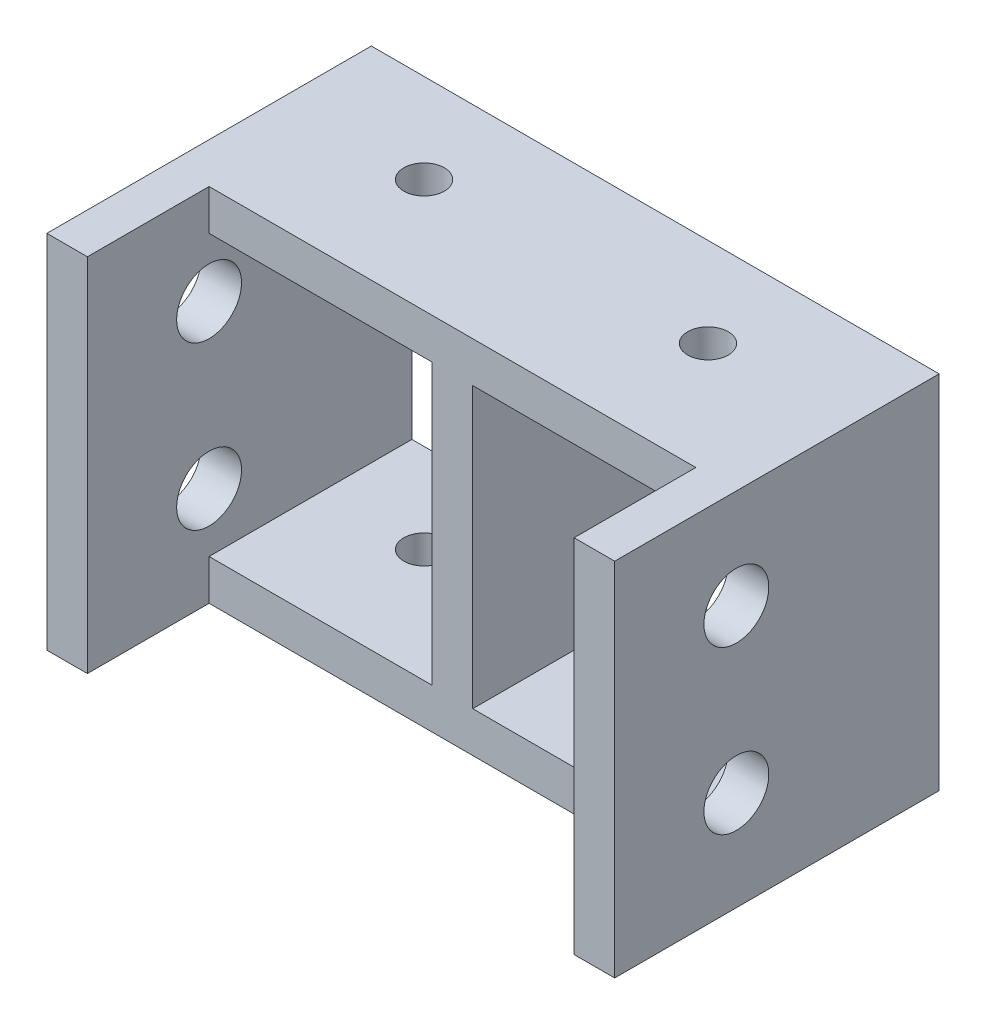
ISO-10303-21;
HEADER;
FILE_DESCRIPTION(('STEP AP214'),'2;1');
FILE_NAME('part.step','',(''),(''),'','','');
FILE_SCHEMA(('AUTOMOTIVE_DESIGN { 1 0 10303 214 1 1 1 1 }'));
ENDSEC;
DATA;
#1=APPLICATION_CONTEXT('core data for automotive mechanical design processes');
#2=APPLICATION_PROTOCOL_DEFINITION('international standard','automotive_design',2000,#1);
#3=PRODUCT_CONTEXT('',#1,'mechanical');
#4=PRODUCT('Part','Part','',(#3));
#5=PRODUCT_RELATED_PRODUCT_CATEGORY('part','',(#4));
#6=PRODUCT_DEFINITION_FORMATION('','',#4);
#7=PRODUCT_DEFINITION_CONTEXT('part definition',#1,'design');
#8=PRODUCT_DEFINITION('design','',#6,#7);
#9=PRODUCT_DEFINITION_SHAPE('','',#8);
#10=(LENGTH_UNIT() NAMED_UNIT(*) SI_UNIT(.MILLI.,.METRE.));
#11=(NAMED_UNIT(*) PLANE_ANGLE_UNIT() SI_UNIT($,.RADIAN.));
#12=(NAMED_UNIT(*) SI_UNIT($,.STERADIAN.) SOLID_ANGLE_UNIT());
#13=UNCERTAINTY_MEASURE_WITH_UNIT(LENGTH_MEASURE(1.E-05),#10,'distance_accuracy_value','');
#14=(GEOMETRIC_REPRESENTATION_CONTEXT(3) GLOBAL_UNCERTAINTY_ASSIGNED_CONTEXT((#13)) GLOBAL_UNIT_ASSIGNED_CONTEXT((#10,
#11,#12)) REPRESENTATION_CONTEXT('',''));
#15=CARTESIAN_POINT('',(0.,0.,0.));
#16=DIRECTION('',(0.,0.,1.));
#17=DIRECTION('',(1.,0.,0.));
#18=AXIS2_PLACEMENT_3D('',#15,#16,#17);
#19=CARTESIAN_POINT('',(0.,0.,50.));
#20=DIRECTION('',(0.,0.,1.));
#21=DIRECTION('',(1.,0.,0.));
#22=AXIS2_PLACEMENT_3D('',#19,#20,#21);
#23=PLANE('',#22);
#24=DIRECTION('',(1.,0.,0.));
#25=VECTOR('',#24,1.);
#26=CARTESIAN_POINT('',(-70.,-44.980959066833,50.));
#27=LINE('',#26,#25);
#28=CARTESIAN_POINT('',(-60.,-44.980959066833,50.));
#29=VERTEX_POINT('',#28);
#30=CARTESIAN_POINT('',(60.,-44.980959066833,50.));
#31=VERTEX_POINT('',#30);
#32=EDGE_CURVE('E50',#29,#31,#27,.T.);
#33=ORIENTED_EDGE('',*,*,#32,.T.);
#34=DIRECTION('',(0.,-1.,0.));
#35=VECTOR('',#34,1.);
#36=CARTESIAN_POINT('',(60.,44.019040933167,50.));
#37=LINE('',#36,#35);
#38=CARTESIAN_POINT('',(60.,-34.980959066833,50.));
#39=VERTEX_POINT('',#38);
#40=EDGE_CURVE('E181',#39,#31,#37,.T.);
#41=ORIENTED_EDGE('',*,*,#40,.F.);
#42=DIRECTION('',(1.,0.,0.));
#43=VECTOR('',#42,1.);
#44=CARTESIAN_POINT('',(5.,-34.980959066833,50.));
#45=LINE('',#44,#43);
#46=CARTESIAN_POINT('',(5.,-34.980959066833,50.));
#47=VERTEX_POINT('',#46);
#48=EDGE_CURVE('E237',#47,#39,#45,.T.);
#49=ORIENTED_EDGE('',*,*,#48,.F.);
#50=DIRECTION('',(0.,-1.,0.));
#51=VECTOR('',#50,1.);
#52=CARTESIAN_POINT('',(5.,34.019040933167,50.));
#53=LINE('',#52,#51);
#54=CARTESIAN_POINT('',(5.,34.019040933167,50.));
#55=VERTEX_POINT('',#54);
#56=EDGE_CURVE('E244',#55,#47,#53,.T.);
#57=ORIENTED_EDGE('',*,*,#56,.F.);
#58=DIRECTION('',(-1.,0.,0.));
#59=VECTOR('',#58,1.);
#60=CARTESIAN_POINT('',(5.,34.019040933167,50.));
#61=LINE('',#60,#59);
#62=CARTESIAN_POINT('',(60.,34.019040933167,50.));
#63=VERTEX_POINT('',#62);
#64=EDGE_CURVE('E240',#63,#55,#61,.T.);
#65=ORIENTED_EDGE('',*,*,#64,.F.);
#66=CARTESIAN_POINT('',(60.,44.019040933167,50.));
#67=VERTEX_POINT('',#66);
#68=EDGE_CURVE('E57',#67,#63,#37,.T.);
#69=ORIENTED_EDGE('',*,*,#68,.F.);
#70=DIRECTION('',(-1.,0.,0.));
#71=VECTOR('',#70,1.);
#72=CARTESIAN_POINT('',(-70.,44.019040933167,50.));
#73=LINE('',#72,#71);
#74=CARTESIAN_POINT('',(-60.,44.019040933167,50.));
#75=VERTEX_POINT('',#74);
#76=EDGE_CURVE('E298',#67,#75,#73,.T.);
#77=ORIENTED_EDGE('',*,*,#76,.T.);
#78=DIRECTION('',(0.,-1.,0.));
#79=VECTOR('',#78,1.);
#80=CARTESIAN_POINT('',(-60.,44.019040933167,50.));
#81=LINE('',#80,#79);
#82=CARTESIAN_POINT('',(-60.,34.019040933167,50.));
#83=VERTEX_POINT('',#82);
#84=EDGE_CURVE('E190',#75,#83,#81,.T.);
#85=ORIENTED_EDGE('',*,*,#84,.T.);
#86=DIRECTION('',(-1.,0.,0.));
#87=VECTOR('',#86,1.);
#88=CARTESIAN_POINT('',(-60.,34.019040933167,50.));
#89=LINE('',#88,#87);
#90=CARTESIAN_POINT('',(-5.,34.019040933167,50.));
#91=VERTEX_POINT('',#90);
#92=EDGE_CURVE('E273',#91,#83,#89,.T.);
#93=ORIENTED_EDGE('',*,*,#92,.F.);
#94=DIRECTION('',(0.,1.,0.));
#95=VECTOR('',#94,1.);
#96=CARTESIAN_POINT('',(-5.,34.019040933167,50.));
#97=LINE('',#96,#95);
#98=CARTESIAN_POINT('',(-5.,-34.980959066833,50.));
#99=VERTEX_POINT('',#98);
#100=EDGE_CURVE('E269',#99,#91,#97,.T.);
#101=ORIENTED_EDGE('',*,*,#100,.F.);
#102=DIRECTION('',(1.,0.,0.));
#103=VECTOR('',#102,1.);
#104=CARTESIAN_POINT('',(-60.,-34.980959066833,50.));
#105=LINE('',#104,#103);
#106=CARTESIAN_POINT('',(-60.,-34.980959066833,50.));
#107=VERTEX_POINT('',#106);
#108=EDGE_CURVE('E267',#107,#99,#105,.T.);
#109=ORIENTED_EDGE('',*,*,#108,.F.);
#110=EDGE_CURVE('E183',#107,#29,#81,.T.);
#111=ORIENTED_EDGE('',*,*,#110,.T.);
#112=EDGE_LOOP('',(#33,#41,#49,#57,#65,#69,#77,#85,#93,#101,#109,#111));
#113=FACE_BOUND('',#112,.T.);
#114=ADVANCED_FACE('F35',(#113),#23,.T.);
#115=CARTESIAN_POINT('',(0.,0.,0.));
#116=DIRECTION('',(0.,0.,1.));
#117=DIRECTION('',(1.,0.,0.));
#118=AXIS2_PLACEMENT_3D('',#115,#116,#117);
#119=PLANE('',#118);
#120=DIRECTION('',(0.,-1.,0.));
#121=VECTOR('',#120,1.);
#122=CARTESIAN_POINT('',(-60.,34.019040933167,0.));
#123=LINE('',#122,#121);
#124=CARTESIAN_POINT('',(-60.,34.019040933167,0.));
#125=VERTEX_POINT('',#124);
#126=CARTESIAN_POINT('',(-60.,-34.980959066833,0.));
#127=VERTEX_POINT('',#126);
#128=EDGE_CURVE('E266',#125,#127,#123,.T.);
#129=ORIENTED_EDGE('',*,*,#128,.T.);
#130=DIRECTION('',(1.,0.,0.));
#131=VECTOR('',#130,1.);
#132=CARTESIAN_POINT('',(-60.,-34.980959066833,0.));
#133=LINE('',#132,#131);
#134=CARTESIAN_POINT('',(-5.,-34.980959066833,0.));
#135=VERTEX_POINT('',#134);
#136=EDGE_CURVE('E279',#127,#135,#133,.T.);
#137=ORIENTED_EDGE('',*,*,#136,.T.);
#138=DIRECTION('',(0.,1.,0.));
#139=VECTOR('',#138,1.);
#140=CARTESIAN_POINT('',(-5.,34.019040933167,0.));
#141=LINE('',#140,#139);
#142=CARTESIAN_POINT('',(-5.,34.019040933167,0.));
#143=VERTEX_POINT('',#142);
#144=EDGE_CURVE('E282',#135,#143,#141,.T.);
#145=ORIENTED_EDGE('',*,*,#144,.T.);
#146=DIRECTION('',(-1.,0.,0.));
#147=VECTOR('',#146,1.);
#148=CARTESIAN_POINT('',(-60.,34.019040933167,0.));
#149=LINE('',#148,#147);
#150=EDGE_CURVE('E270',#143,#125,#149,.T.);
#151=ORIENTED_EDGE('',*,*,#150,.T.);
#152=EDGE_LOOP('',(#129,#137,#145,#151));
#153=FACE_BOUND('',#152,.T.);
#154=DIRECTION('',(0.,-1.,0.));
#155=VECTOR('',#154,1.);
#156=CARTESIAN_POINT('',(-70.,44.019040933167,0.));
#157=LINE('',#156,#155);
#158=CARTESIAN_POINT('',(-70.,44.019040933167,0.));
#159=VERTEX_POINT('',#158);
#160=CARTESIAN_POINT('',(-70.,-44.980959066833,0.));
#161=VERTEX_POINT('',#160);
#162=EDGE_CURVE('E296',#159,#161,#157,.T.);
#163=ORIENTED_EDGE('',*,*,#162,.F.);
#164=DIRECTION('',(-1.,0.,0.));
#165=VECTOR('',#164,1.);
#166=CARTESIAN_POINT('',(-70.,44.019040933167,0.));
#167=LINE('',#166,#165);
#168=CARTESIAN_POINT('',(70.,44.019040933167,0.));
#169=VERTEX_POINT('',#168);
#170=EDGE_CURVE('E299',#169,#159,#167,.T.);
#171=ORIENTED_EDGE('',*,*,#170,.F.);
#172=DIRECTION('',(0.,1.,0.));
#173=VECTOR('',#172,1.);
#174=CARTESIAN_POINT('',(70.,44.019040933167,0.));
#175=LINE('',#174,#173);
#176=CARTESIAN_POINT('',(70.,-44.980959066833,0.));
#177=VERTEX_POINT('',#176);
#178=EDGE_CURVE('E156',#177,#169,#175,.T.);
#179=ORIENTED_EDGE('',*,*,#178,.F.);
#180=DIRECTION('',(1.,0.,0.));
#181=VECTOR('',#180,1.);
#182=CARTESIAN_POINT('',(-70.,-44.980959066833,0.));
#183=LINE('',#182,#181);
#184=EDGE_CURVE('E303',#161,#177,#183,.T.);
#185=ORIENTED_EDGE('',*,*,#184,.F.);
#186=EDGE_LOOP('',(#163,#171,#179,#185));
#187=FACE_BOUND('',#186,.T.);
#188=DIRECTION('',(1.,0.,0.));
#189=VECTOR('',#188,1.);
#190=CARTESIAN_POINT('',(5.,-34.980959066833,0.));
#191=LINE('',#190,#189);
#192=CARTESIAN_POINT('',(5.,-34.980959066833,0.));
#193=VERTEX_POINT('',#192);
#194=CARTESIAN_POINT('',(60.,-34.980959066833,0.));
#195=VERTEX_POINT('',#194);
#196=EDGE_CURVE('E236',#193,#195,#191,.T.);
#197=ORIENTED_EDGE('',*,*,#196,.T.);
#198=DIRECTION('',(0.,1.,0.));
#199=VECTOR('',#198,1.);
#200=CARTESIAN_POINT('',(60.,34.019040933167,0.));
#201=LINE('',#200,#199);
#202=CARTESIAN_POINT('',(60.,34.019040933167,0.));
#203=VERTEX_POINT('',#202);
#204=EDGE_CURVE('E249',#195,#203,#201,.T.);
#205=ORIENTED_EDGE('',*,*,#204,.T.);
#206=DIRECTION('',(-1.,0.,0.));
#207=VECTOR('',#206,1.);
#208=CARTESIAN_POINT('',(5.,34.019040933167,0.));
#209=LINE('',#208,#207);
#210=CARTESIAN_POINT('',(5.,34.019040933167,0.));
#211=VERTEX_POINT('',#210);
#212=EDGE_CURVE('E252',#203,#211,#209,.T.);
#213=ORIENTED_EDGE('',*,*,#212,.T.);
#214=DIRECTION('',(0.,-1.,0.));
#215=VECTOR('',#214,1.);
#216=CARTESIAN_POINT('',(5.,34.019040933167,0.));
#217=LINE('',#216,#215);
#218=EDGE_CURVE('E241',#211,#193,#217,.T.);
#219=ORIENTED_EDGE('',*,*,#218,.T.);
#220=EDGE_LOOP('',(#197,#205,#213,#219));
#221=FACE_BOUND('',#220,.T.);
#222=ADVANCED_FACE('F345',(#153,#187,#221),#119,.F.);
#223=CARTESIAN_POINT('',(-70.,44.019040933167,50.));
#224=DIRECTION('',(1.,0.,0.));
#225=DIRECTION('',(0.,1.,0.));
#226=AXIS2_PLACEMENT_3D('',#223,#224,#225);
#227=PLANE('',#226);
#228=DIRECTION('',(0.,0.,-1.));
#229=VECTOR('',#228,1.);
#230=CARTESIAN_POINT('',(-70.,-44.980959066833,50.));
#231=LINE('',#230,#229);
#232=CARTESIAN_POINT('',(-70.,-44.980959066833,80.));
#233=VERTEX_POINT('',#232);
#234=EDGE_CURVE('E310',#233,#161,#231,.T.);
#235=ORIENTED_EDGE('',*,*,#234,.F.);
#236=DIRECTION('',(0.,-1.,0.));
#237=VECTOR('',#236,1.);
#238=CARTESIAN_POINT('',(-70.,44.019040933167,80.));
#239=LINE('',#238,#237);
#240=CARTESIAN_POINT('',(-70.,44.019040933167,80.));
#241=VERTEX_POINT('',#240);
#242=EDGE_CURVE('E195',#241,#233,#239,.T.);
#243=ORIENTED_EDGE('',*,*,#242,.F.);
#244=DIRECTION('',(0.,0.,-1.));
#245=VECTOR('',#244,1.);
#246=CARTESIAN_POINT('',(-70.,44.019040933167,50.));
#247=LINE('',#246,#245);
#248=EDGE_CURVE('E160',#241,#159,#247,.T.);
#249=ORIENTED_EDGE('',*,*,#248,.T.);
#250=ORIENTED_EDGE('',*,*,#162,.T.);
#251=EDGE_LOOP('',(#235,#243,#249,#250));
#252=FACE_BOUND('',#251,.T.);
#253=CARTESIAN_POINT('',(-70.,-20.480959066833,50.));
#254=DIRECTION('',(-1.,0.,0.));
#255=DIRECTION('',(0.,0.,1.));
#256=AXIS2_PLACEMENT_3D('',#253,#254,#255);
#257=CIRCLE('',#256,8.);
#258=CARTESIAN_POINT('',(-70.,-20.480959066833,58.));
#259=VERTEX_POINT('',#258);
#260=EDGE_CURVE('E208',#259,#259,#257,.T.);
#261=ORIENTED_EDGE('',*,*,#260,.F.);
#262=EDGE_LOOP('',(#261));
#263=FACE_BOUND('',#262,.T.);
#264=CARTESIAN_POINT('',(-70.,19.519040933167,50.));
#265=DIRECTION('',(-1.,0.,0.));
#266=DIRECTION('',(0.,0.,1.));
#267=AXIS2_PLACEMENT_3D('',#264,#265,#266);
#268=CIRCLE('',#267,8.);
#269=CARTESIAN_POINT('',(-70.,19.519040933167,58.));
#270=VERTEX_POINT('',#269);
#271=EDGE_CURVE('E211',#270,#270,#268,.T.);
#272=ORIENTED_EDGE('',*,*,#271,.F.);
#273=EDGE_LOOP('',(#272));
#274=FACE_BOUND('',#273,.T.);
#275=ADVANCED_FACE('F37',(#252,#263,#274),#227,.F.);
#276=CARTESIAN_POINT('',(-70.,-44.980959066833,50.));
#277=DIRECTION('',(0.,1.,0.));
#278=DIRECTION('',(0.,0.,1.));
#279=AXIS2_PLACEMENT_3D('',#276,#277,#278);
#280=PLANE('',#279);
#281=CARTESIAN_POINT('',(-35.,-44.980959066833,22.));
#282=DIRECTION('',(0.,1.,0.));
#283=DIRECTION('',(0.,0.,1.));
#284=AXIS2_PLACEMENT_3D('',#281,#282,#283);
#285=CIRCLE('',#284,5.);
#286=CARTESIAN_POINT('',(-35.,-44.980959066833,27.));
#287=VERTEX_POINT('',#286);
#288=EDGE_CURVE('E233',#287,#287,#285,.T.);
#289=ORIENTED_EDGE('',*,*,#288,.T.);
#290=EDGE_LOOP('',(#289));
#291=FACE_BOUND('',#290,.T.);
#292=CARTESIAN_POINT('',(35.,-44.980959066833,22.));
#293=DIRECTION('',(0.,1.,0.));
#294=DIRECTION('',(0.,0.,1.));
#295=AXIS2_PLACEMENT_3D('',#292,#293,#294);
#296=CIRCLE('',#295,5.);
#297=CARTESIAN_POINT('',(35.,-44.980959066833,27.));
#298=VERTEX_POINT('',#297);
#299=EDGE_CURVE('E226',#298,#298,#296,.T.);
#300=ORIENTED_EDGE('',*,*,#299,.T.);
#301=EDGE_LOOP('',(#300));
#302=FACE_BOUND('',#301,.T.);
#303=ORIENTED_EDGE('',*,*,#184,.T.);
#304=DIRECTION('',(0.,0.,-1.));
#305=VECTOR('',#304,1.);
#306=CARTESIAN_POINT('',(70.,-44.980959066833,50.));
#307=LINE('',#306,#305);
#308=CARTESIAN_POINT('',(70.,-44.980959066833,80.));
#309=VERTEX_POINT('',#308);
#310=EDGE_CURVE('E159',#309,#177,#307,.T.);
#311=ORIENTED_EDGE('',*,*,#310,.F.);
#312=DIRECTION('',(-1.,0.,0.));
#313=VECTOR('',#312,1.);
#314=CARTESIAN_POINT('',(70.,-44.980959066833,80.));
#315=LINE('',#314,#313);
#316=CARTESIAN_POINT('',(60.,-44.980959066833,80.));
#317=VERTEX_POINT('',#316);
#318=EDGE_CURVE('E173',#309,#317,#315,.T.);
#319=ORIENTED_EDGE('',*,*,#318,.T.);
#320=DIRECTION('',(0.,0.,-1.));
#321=VECTOR('',#320,1.);
#322=CARTESIAN_POINT('',(60.,-44.980959066833,80.));
#323=LINE('',#322,#321);
#324=EDGE_CURVE('E179',#317,#31,#323,.T.);
#325=ORIENTED_EDGE('',*,*,#324,.T.);
#326=ORIENTED_EDGE('',*,*,#32,.F.);
#327=DIRECTION('',(0.,0.,-1.));
#328=VECTOR('',#327,1.);
#329=CARTESIAN_POINT('',(-60.,-44.980959066833,80.));
#330=LINE('',#329,#328);
#331=CARTESIAN_POINT('',(-60.,-44.980959066833,80.));
#332=VERTEX_POINT('',#331);
#333=EDGE_CURVE('E200',#332,#29,#330,.T.);
#334=ORIENTED_EDGE('',*,*,#333,.F.);
#335=DIRECTION('',(1.,0.,0.));
#336=VECTOR('',#335,1.);
#337=CARTESIAN_POINT('',(-70.,-44.980959066833,80.));
#338=LINE('',#337,#336);
#339=EDGE_CURVE('E193',#233,#332,#338,.T.);
#340=ORIENTED_EDGE('',*,*,#339,.F.);
#341=ORIENTED_EDGE('',*,*,#234,.T.);
#342=EDGE_LOOP('',(#303,#311,#319,#325,#326,#334,#340,#341));
#343=FACE_BOUND('',#342,.T.);
#344=ADVANCED_FACE('F360',(#291,#302,#343),#280,.F.);
#345=CARTESIAN_POINT('',(70.,44.019040933167,50.));
#346=DIRECTION('',(-1.,0.,0.));
#347=DIRECTION('',(0.,-1.,0.));
#348=AXIS2_PLACEMENT_3D('',#345,#346,#347);
#349=PLANE('',#348);
#350=CARTESIAN_POINT('',(70.,19.519040933167,50.));
#351=DIRECTION('',(-1.,0.,0.));
#352=DIRECTION('',(0.,0.,1.));
#353=AXIS2_PLACEMENT_3D('',#350,#351,#352);
#354=CIRCLE('',#353,8.);
#355=CARTESIAN_POINT('',(70.,19.519040933167,58.));
#356=VERTEX_POINT('',#355);
#357=EDGE_CURVE('E205',#356,#356,#354,.T.);
#358=ORIENTED_EDGE('',*,*,#357,.T.);
#359=EDGE_LOOP('',(#358));
#360=FACE_BOUND('',#359,.T.);
#361=CARTESIAN_POINT('',(70.,-20.480959066833,50.));
#362=DIRECTION('',(-1.,0.,0.));
#363=DIRECTION('',(0.,0.,1.));
#364=AXIS2_PLACEMENT_3D('',#361,#362,#363);
#365=CIRCLE('',#364,8.);
#366=CARTESIAN_POINT('',(70.,-20.480959066833,58.));
#367=VERTEX_POINT('',#366);
#368=EDGE_CURVE('E202',#367,#367,#365,.T.);
#369=ORIENTED_EDGE('',*,*,#368,.T.);
#370=EDGE_LOOP('',(#369));
#371=FACE_BOUND('',#370,.T.);
#372=DIRECTION('',(0.,0.,-1.));
#373=VECTOR('',#372,1.);
#374=CARTESIAN_POINT('',(70.,44.019040933167,50.));
#375=LINE('',#374,#373);
#376=CARTESIAN_POINT('',(70.,44.019040933167,80.));
#377=VERTEX_POINT('',#376);
#378=EDGE_CURVE('E149',#377,#169,#375,.T.);
#379=ORIENTED_EDGE('',*,*,#378,.F.);
#380=DIRECTION('',(0.,-1.,0.));
#381=VECTOR('',#380,1.);
#382=CARTESIAN_POINT('',(70.,44.019040933167,80.));
#383=LINE('',#382,#381);
#384=EDGE_CURVE('E154',#377,#309,#383,.T.);
#385=ORIENTED_EDGE('',*,*,#384,.T.);
#386=ORIENTED_EDGE('',*,*,#310,.T.);
#387=ORIENTED_EDGE('',*,*,#178,.T.);
#388=EDGE_LOOP('',(#379,#385,#386,#387));
#389=FACE_BOUND('',#388,.T.);
#390=ADVANCED_FACE('F151',(#360,#371,#389),#349,.F.);
#391=CARTESIAN_POINT('',(-70.,44.019040933167,50.));
#392=DIRECTION('',(0.,-1.,0.));
#393=DIRECTION('',(0.,0.,-1.));
#394=AXIS2_PLACEMENT_3D('',#391,#392,#393);
#395=PLANE('',#394);
#396=CARTESIAN_POINT('',(-35.,44.019040933167,22.));
#397=DIRECTION('',(0.,-1.,0.));
#398=DIRECTION('',(0.,0.,-1.));
#399=AXIS2_PLACEMENT_3D('',#396,#397,#398);
#400=CIRCLE('',#399,5.);
#401=CARTESIAN_POINT('',(-35.,44.019040933167,17.));
#402=VERTEX_POINT('',#401);
#403=EDGE_CURVE('E217',#402,#402,#400,.T.);
#404=ORIENTED_EDGE('',*,*,#403,.T.);
#405=EDGE_LOOP('',(#404));
#406=FACE_BOUND('',#405,.T.);
#407=CARTESIAN_POINT('',(35.,44.019040933167,22.));
#408=DIRECTION('',(0.,-1.,0.));
#409=DIRECTION('',(0.,0.,-1.));
#410=AXIS2_PLACEMENT_3D('',#407,#408,#409);
#411=CIRCLE('',#410,5.);
#412=CARTESIAN_POINT('',(35.,44.019040933167,17.));
#413=VERTEX_POINT('',#412);
#414=EDGE_CURVE('E214',#413,#413,#411,.T.);
#415=ORIENTED_EDGE('',*,*,#414,.T.);
#416=EDGE_LOOP('',(#415));
#417=FACE_BOUND('',#416,.T.);
#418=ORIENTED_EDGE('',*,*,#170,.T.);
#419=ORIENTED_EDGE('',*,*,#248,.F.);
#420=DIRECTION('',(1.,0.,0.));
#421=VECTOR('',#420,1.);
#422=CARTESIAN_POINT('',(-70.,44.019040933167,80.));
#423=LINE('',#422,#421);
#424=CARTESIAN_POINT('',(-60.,44.019040933167,80.));
#425=VERTEX_POINT('',#424);
#426=EDGE_CURVE('E186',#241,#425,#423,.T.);
#427=ORIENTED_EDGE('',*,*,#426,.T.);
#428=DIRECTION('',(0.,0.,-1.));
#429=VECTOR('',#428,1.);
#430=CARTESIAN_POINT('',(-60.,44.019040933167,80.));
#431=LINE('',#430,#429);
#432=EDGE_CURVE('E198',#425,#75,#431,.T.);
#433=ORIENTED_EDGE('',*,*,#432,.T.);
#434=ORIENTED_EDGE('',*,*,#76,.F.);
#435=DIRECTION('',(0.,0.,-1.));
#436=VECTOR('',#435,1.);
#437=CARTESIAN_POINT('',(60.,44.019040933167,80.));
#438=LINE('',#437,#436);
#439=CARTESIAN_POINT('',(60.,44.019040933167,80.));
#440=VERTEX_POINT('',#439);
#441=EDGE_CURVE('E167',#440,#67,#438,.T.);
#442=ORIENTED_EDGE('',*,*,#441,.F.);
#443=DIRECTION('',(-1.,0.,0.));
#444=VECTOR('',#443,1.);
#445=CARTESIAN_POINT('',(70.,44.019040933167,80.));
#446=LINE('',#445,#444);
#447=EDGE_CURVE('E164',#377,#440,#446,.T.);
#448=ORIENTED_EDGE('',*,*,#447,.F.);
#449=ORIENTED_EDGE('',*,*,#378,.T.);
#450=EDGE_LOOP('',(#418,#419,#427,#433,#434,#442,#448,#449));
#451=FACE_BOUND('',#450,.T.);
#452=ADVANCED_FACE('F165',(#406,#417,#451),#395,.F.);
#453=CARTESIAN_POINT('',(-60.,34.019040933167,50.));
#454=DIRECTION('',(1.,0.,0.));
#455=DIRECTION('',(0.,1.,0.));
#456=AXIS2_PLACEMENT_3D('',#453,#454,#455);
#457=PLANE('',#456);
#458=CARTESIAN_POINT('',(-60.,19.519040933167,50.));
#459=DIRECTION('',(1.,0.,0.));
#460=DIRECTION('',(0.,1.,0.));
#461=AXIS2_PLACEMENT_3D('',#458,#459,#460);
#462=CIRCLE('',#461,8.);
#463=CARTESIAN_POINT('',(-60.,27.519040933167,50.));
#464=VERTEX_POINT('',#463);
#465=EDGE_CURVE('E320',#464,#464,#462,.T.);
#466=ORIENTED_EDGE('',*,*,#465,.F.);
#467=EDGE_LOOP('',(#466));
#468=FACE_BOUND('',#467,.T.);
#469=CARTESIAN_POINT('',(-60.,-20.480959066833,50.));
#470=DIRECTION('',(1.,0.,0.));
#471=DIRECTION('',(0.,1.,0.));
#472=AXIS2_PLACEMENT_3D('',#469,#470,#471);
#473=CIRCLE('',#472,8.);
#474=CARTESIAN_POINT('',(-60.,-12.480959066833,50.));
#475=VERTEX_POINT('',#474);
#476=EDGE_CURVE('E313',#475,#475,#473,.T.);
#477=ORIENTED_EDGE('',*,*,#476,.F.);
#478=EDGE_LOOP('',(#477));
#479=FACE_BOUND('',#478,.T.);
#480=ORIENTED_EDGE('',*,*,#110,.F.);
#481=DIRECTION('',(0.,0.,-1.));
#482=VECTOR('',#481,1.);
#483=CARTESIAN_POINT('',(-60.,-34.980959066833,50.));
#484=LINE('',#483,#482);
#485=EDGE_CURVE('E293',#107,#127,#484,.T.);
#486=ORIENTED_EDGE('',*,*,#485,.T.);
#487=ORIENTED_EDGE('',*,*,#128,.F.);
#488=DIRECTION('',(0.,0.,-1.));
#489=VECTOR('',#488,1.);
#490=CARTESIAN_POINT('',(-60.,34.019040933167,50.));
#491=LINE('',#490,#489);
#492=EDGE_CURVE('E276',#83,#125,#491,.T.);
#493=ORIENTED_EDGE('',*,*,#492,.F.);
#494=ORIENTED_EDGE('',*,*,#84,.F.);
#495=ORIENTED_EDGE('',*,*,#432,.F.);
#496=DIRECTION('',(0.,-1.,0.));
#497=VECTOR('',#496,1.);
#498=CARTESIAN_POINT('',(-60.,44.019040933167,80.));
#499=LINE('',#498,#497);
#500=EDGE_CURVE('E189',#425,#332,#499,.T.);
#501=ORIENTED_EDGE('',*,*,#500,.T.);
#502=ORIENTED_EDGE('',*,*,#333,.T.);
#503=EDGE_LOOP('',(#480,#486,#487,#493,#494,#495,#501,#502));
#504=FACE_BOUND('',#503,.T.);
#505=ADVANCED_FACE('F353',(#468,#479,#504),#457,.T.);
#506=CARTESIAN_POINT('',(-60.,-34.980959066833,50.));
#507=DIRECTION('',(0.,1.,0.));
#508=DIRECTION('',(0.,0.,1.));
#509=AXIS2_PLACEMENT_3D('',#506,#507,#508);
#510=PLANE('',#509);
#511=CARTESIAN_POINT('',(-35.,-34.980959066833,22.));
#512=DIRECTION('',(0.,1.,0.));
#513=DIRECTION('',(0.,0.,1.));
#514=AXIS2_PLACEMENT_3D('',#511,#512,#513);
#515=CIRCLE('',#514,5.);
#516=CARTESIAN_POINT('',(-35.,-34.980959066833,27.));
#517=VERTEX_POINT('',#516);
#518=EDGE_CURVE('E230',#517,#517,#515,.T.);
#519=ORIENTED_EDGE('',*,*,#518,.F.);
#520=EDGE_LOOP('',(#519));
#521=FACE_BOUND('',#520,.T.);
#522=ORIENTED_EDGE('',*,*,#136,.F.);
#523=ORIENTED_EDGE('',*,*,#485,.F.);
#524=ORIENTED_EDGE('',*,*,#108,.T.);
#525=DIRECTION('',(0.,0.,-1.));
#526=VECTOR('',#525,1.);
#527=CARTESIAN_POINT('',(-5.,-34.980959066833,50.));
#528=LINE('',#527,#526);
#529=EDGE_CURVE('E291',#99,#135,#528,.T.);
#530=ORIENTED_EDGE('',*,*,#529,.T.);
#531=EDGE_LOOP('',(#522,#523,#524,#530));
#532=FACE_BOUND('',#531,.T.);
#533=ADVANCED_FACE('F396',(#521,#532),#510,.T.);
#534=CARTESIAN_POINT('',(-5.,34.019040933167,50.));
#535=DIRECTION('',(-1.,0.,0.));
#536=DIRECTION('',(0.,-1.,0.));
#537=AXIS2_PLACEMENT_3D('',#534,#535,#536);
#538=PLANE('',#537);
#539=ORIENTED_EDGE('',*,*,#144,.F.);
#540=ORIENTED_EDGE('',*,*,#529,.F.);
#541=ORIENTED_EDGE('',*,*,#100,.T.);
#542=DIRECTION('',(0.,0.,-1.));
#543=VECTOR('',#542,1.);
#544=CARTESIAN_POINT('',(-5.,34.019040933167,50.));
#545=LINE('',#544,#543);
#546=EDGE_CURVE('E289',#91,#143,#545,.T.);
#547=ORIENTED_EDGE('',*,*,#546,.T.);
#548=EDGE_LOOP('',(#539,#540,#541,#547));
#549=FACE_BOUND('',#548,.T.);
#550=ADVANCED_FACE('F392',(#549),#538,.T.);
#551=CARTESIAN_POINT('',(-60.,34.019040933167,50.));
#552=DIRECTION('',(0.,-1.,0.));
#553=DIRECTION('',(0.,0.,-1.));
#554=AXIS2_PLACEMENT_3D('',#551,#552,#553);
#555=PLANE('',#554);
#556=CARTESIAN_POINT('',(-35.,34.019040933167,22.));
#557=DIRECTION('',(0.,-1.,0.));
#558=DIRECTION('',(0.,0.,-1.));
#559=AXIS2_PLACEMENT_3D('',#556,#557,#558);
#560=CIRCLE('',#559,5.);
#561=CARTESIAN_POINT('',(-35.,34.019040933167,17.));
#562=VERTEX_POINT('',#561);
#563=EDGE_CURVE('E229',#562,#562,#560,.T.);
#564=ORIENTED_EDGE('',*,*,#563,.F.);
#565=EDGE_LOOP('',(#564));
#566=FACE_BOUND('',#565,.T.);
#567=ORIENTED_EDGE('',*,*,#150,.F.);
#568=ORIENTED_EDGE('',*,*,#546,.F.);
#569=ORIENTED_EDGE('',*,*,#92,.T.);
#570=ORIENTED_EDGE('',*,*,#492,.T.);
#571=EDGE_LOOP('',(#567,#568,#569,#570));
#572=FACE_BOUND('',#571,.T.);
#573=ADVANCED_FACE('F388',(#566,#572),#555,.T.);
#574=CARTESIAN_POINT('',(5.,-34.980959066833,50.));
#575=DIRECTION('',(0.,1.,0.));
#576=DIRECTION('',(0.,0.,1.));
#577=AXIS2_PLACEMENT_3D('',#574,#575,#576);
#578=PLANE('',#577);
#579=CARTESIAN_POINT('',(35.,-34.980959066833,22.));
#580=DIRECTION('',(0.,1.,0.));
#581=DIRECTION('',(0.,0.,1.));
#582=AXIS2_PLACEMENT_3D('',#579,#580,#581);
#583=CIRCLE('',#582,5.);
#584=CARTESIAN_POINT('',(35.,-34.980959066833,27.));
#585=VERTEX_POINT('',#584);
#586=EDGE_CURVE('E223',#585,#585,#583,.T.);
#587=ORIENTED_EDGE('',*,*,#586,.F.);
#588=EDGE_LOOP('',(#587));
#589=FACE_BOUND('',#588,.T.);
#590=ORIENTED_EDGE('',*,*,#196,.F.);
#591=DIRECTION('',(0.,0.,-1.));
#592=VECTOR('',#591,1.);
#593=CARTESIAN_POINT('',(5.,-34.980959066833,50.));
#594=LINE('',#593,#592);
#595=EDGE_CURVE('E246',#47,#193,#594,.T.);
#596=ORIENTED_EDGE('',*,*,#595,.F.);
#597=ORIENTED_EDGE('',*,*,#48,.T.);
#598=DIRECTION('',(0.,0.,-1.));
#599=VECTOR('',#598,1.);
#600=CARTESIAN_POINT('',(60.,-34.980959066833,50.));
#601=LINE('',#600,#599);
#602=EDGE_CURVE('E263',#39,#195,#601,.T.);
#603=ORIENTED_EDGE('',*,*,#602,.T.);
#604=EDGE_LOOP('',(#590,#596,#597,#603));
#605=FACE_BOUND('',#604,.T.);
#606=ADVANCED_FACE('F406',(#589,#605),#578,.T.);
#607=CARTESIAN_POINT('',(60.,34.019040933167,50.));
#608=DIRECTION('',(-1.,0.,0.));
#609=DIRECTION('',(0.,0.,1.));
#610=AXIS2_PLACEMENT_3D('',#607,#608,#609);
#611=PLANE('',#610);
#612=ORIENTED_EDGE('',*,*,#68,.T.);
#613=DIRECTION('',(0.,0.,-1.));
#614=VECTOR('',#613,1.);
#615=CARTESIAN_POINT('',(60.,34.019040933167,50.));
#616=LINE('',#615,#614);
#617=EDGE_CURVE('E261',#63,#203,#616,.T.);
#618=ORIENTED_EDGE('',*,*,#617,.T.);
#619=ORIENTED_EDGE('',*,*,#204,.F.);
#620=ORIENTED_EDGE('',*,*,#602,.F.);
#621=ORIENTED_EDGE('',*,*,#40,.T.);
#622=ORIENTED_EDGE('',*,*,#324,.F.);
#623=DIRECTION('',(0.,-1.,0.));
#624=VECTOR('',#623,1.);
#625=CARTESIAN_POINT('',(60.,44.019040933167,80.));
#626=LINE('',#625,#624);
#627=EDGE_CURVE('E175',#440,#317,#626,.T.);
#628=ORIENTED_EDGE('',*,*,#627,.F.);
#629=ORIENTED_EDGE('',*,*,#441,.T.);
#630=EDGE_LOOP('',(#612,#618,#619,#620,#621,#622,#628,#629));
#631=FACE_BOUND('',#630,.T.);
#632=CARTESIAN_POINT('',(60.,19.519040933167,50.));
#633=DIRECTION('',(-1.,0.,0.));
#634=DIRECTION('',(0.,0.,1.));
#635=AXIS2_PLACEMENT_3D('',#632,#633,#634);
#636=CIRCLE('',#635,8.);
#637=CARTESIAN_POINT('',(60.,19.519040933167,58.));
#638=VERTEX_POINT('',#637);
#639=EDGE_CURVE('E11',#638,#638,#636,.F.);
#640=ORIENTED_EDGE('',*,*,#639,.T.);
#641=EDGE_LOOP('',(#640));
#642=FACE_BOUND('',#641,.T.);
#643=CARTESIAN_POINT('',(60.,-20.480959066833,50.));
#644=DIRECTION('',(-1.,0.,0.));
#645=DIRECTION('',(0.,0.,1.));
#646=AXIS2_PLACEMENT_3D('',#643,#644,#645);
#647=CIRCLE('',#646,8.);
#648=CARTESIAN_POINT('',(60.,-20.480959066833,58.));
#649=VERTEX_POINT('',#648);
#650=EDGE_CURVE('E43',#649,#649,#647,.F.);
#651=ORIENTED_EDGE('',*,*,#650,.T.);
#652=EDGE_LOOP('',(#651));
#653=FACE_BOUND('',#652,.T.);
#654=ADVANCED_FACE('F325',(#631,#642,#653),#611,.T.);
#655=CARTESIAN_POINT('',(5.,34.019040933167,50.));
#656=DIRECTION('',(0.,-1.,0.));
#657=DIRECTION('',(0.,0.,-1.));
#658=AXIS2_PLACEMENT_3D('',#655,#656,#657);
#659=PLANE('',#658);
#660=CARTESIAN_POINT('',(35.,34.019040933167,22.));
#661=DIRECTION('',(0.,-1.,0.));
#662=DIRECTION('',(0.,0.,-1.));
#663=AXIS2_PLACEMENT_3D('',#660,#661,#662);
#664=CIRCLE('',#663,5.);
#665=CARTESIAN_POINT('',(35.,34.019040933167,17.));
#666=VERTEX_POINT('',#665);
#667=EDGE_CURVE('E220',#666,#666,#664,.T.);
#668=ORIENTED_EDGE('',*,*,#667,.F.);
#669=EDGE_LOOP('',(#668));
#670=FACE_BOUND('',#669,.T.);
#671=ORIENTED_EDGE('',*,*,#212,.F.);
#672=ORIENTED_EDGE('',*,*,#617,.F.);
#673=ORIENTED_EDGE('',*,*,#64,.T.);
#674=DIRECTION('',(0.,0.,-1.));
#675=VECTOR('',#674,1.);
#676=CARTESIAN_POINT('',(5.,34.019040933167,50.));
#677=LINE('',#676,#675);
#678=EDGE_CURVE('E259',#55,#211,#677,.T.);
#679=ORIENTED_EDGE('',*,*,#678,.T.);
#680=EDGE_LOOP('',(#671,#672,#673,#679));
#681=FACE_BOUND('',#680,.T.);
#682=ADVANCED_FACE('F412',(#670,#681),#659,.T.);
#683=CARTESIAN_POINT('',(5.,34.019040933167,50.));
#684=DIRECTION('',(1.,0.,0.));
#685=DIRECTION('',(0.,1.,0.));
#686=AXIS2_PLACEMENT_3D('',#683,#684,#685);
#687=PLANE('',#686);
#688=ORIENTED_EDGE('',*,*,#218,.F.);
#689=ORIENTED_EDGE('',*,*,#678,.F.);
#690=ORIENTED_EDGE('',*,*,#56,.T.);
#691=ORIENTED_EDGE('',*,*,#595,.T.);
#692=EDGE_LOOP('',(#688,#689,#690,#691));
#693=FACE_BOUND('',#692,.T.);
#694=ADVANCED_FACE('F409',(#693),#687,.T.);
#695=CARTESIAN_POINT('',(35.,44.019040933167,22.));
#696=DIRECTION('',(0.,-1.,0.));
#697=DIRECTION('',(0.,0.,-1.));
#698=AXIS2_PLACEMENT_3D('',#695,#696,#697);
#699=CYLINDRICAL_SURFACE('',#698,5.);
#700=ORIENTED_EDGE('',*,*,#667,.T.);
#701=EDGE_LOOP('',(#700));
#702=FACE_BOUND('',#701,.T.);
#703=ORIENTED_EDGE('',*,*,#414,.F.);
#704=EDGE_LOOP('',(#703));
#705=FACE_BOUND('',#704,.T.);
#706=ADVANCED_FACE('F420',(#702,#705),#699,.F.);
#707=ORIENTED_EDGE('',*,*,#586,.T.);
#708=EDGE_LOOP('',(#707));
#709=FACE_BOUND('',#708,.T.);
#710=ORIENTED_EDGE('',*,*,#299,.F.);
#711=EDGE_LOOP('',(#710));
#712=FACE_BOUND('',#711,.T.);
#713=ADVANCED_FACE('F452',(#709,#712),#699,.F.);
#714=CARTESIAN_POINT('',(-35.,44.019040933167,22.));
#715=DIRECTION('',(0.,-1.,0.));
#716=DIRECTION('',(0.,0.,-1.));
#717=AXIS2_PLACEMENT_3D('',#714,#715,#716);
#718=CYLINDRICAL_SURFACE('',#717,5.);
#719=ORIENTED_EDGE('',*,*,#563,.T.);
#720=EDGE_LOOP('',(#719));
#721=FACE_BOUND('',#720,.T.);
#722=ORIENTED_EDGE('',*,*,#403,.F.);
#723=EDGE_LOOP('',(#722));
#724=FACE_BOUND('',#723,.T.);
#725=ADVANCED_FACE('F444',(#721,#724),#718,.F.);
#726=ORIENTED_EDGE('',*,*,#518,.T.);
#727=EDGE_LOOP('',(#726));
#728=FACE_BOUND('',#727,.T.);
#729=ORIENTED_EDGE('',*,*,#288,.F.);
#730=EDGE_LOOP('',(#729));
#731=FACE_BOUND('',#730,.T.);
#732=ADVANCED_FACE('F441',(#728,#731),#718,.F.);
#733=CARTESIAN_POINT('',(-55.,-20.480959066833,50.));
#734=DIRECTION('',(-1.,0.,0.));
#735=DIRECTION('',(0.,0.,1.));
#736=AXIS2_PLACEMENT_3D('',#733,#734,#735);
#737=CYLINDRICAL_SURFACE('',#736,8.);
#738=ORIENTED_EDGE('',*,*,#476,.T.);
#739=EDGE_LOOP('',(#738));
#740=FACE_BOUND('',#739,.T.);
#741=ORIENTED_EDGE('',*,*,#260,.T.);
#742=EDGE_LOOP('',(#741));
#743=FACE_BOUND('',#742,.T.);
#744=ADVANCED_FACE('F340',(#740,#743),#737,.F.);
#745=CARTESIAN_POINT('',(-55.,19.519040933167,50.));
#746=DIRECTION('',(-1.,0.,0.));
#747=DIRECTION('',(0.,0.,1.));
#748=AXIS2_PLACEMENT_3D('',#745,#746,#747);
#749=CYLINDRICAL_SURFACE('',#748,8.);
#750=ORIENTED_EDGE('',*,*,#465,.T.);
#751=EDGE_LOOP('',(#750));
#752=FACE_BOUND('',#751,.T.);
#753=ORIENTED_EDGE('',*,*,#271,.T.);
#754=EDGE_LOOP('',(#753));
#755=FACE_BOUND('',#754,.T.);
#756=ADVANCED_FACE('F330',(#752,#755),#749,.F.);
#757=CARTESIAN_POINT('',(55.,-20.480959066833,50.));
#758=DIRECTION('',(1.,0.,0.));
#759=DIRECTION('',(0.,0.,-1.));
#760=AXIS2_PLACEMENT_3D('',#757,#758,#759);
#761=CYLINDRICAL_SURFACE('',#760,8.);
#762=ORIENTED_EDGE('',*,*,#368,.F.);
#763=EDGE_LOOP('',(#762));
#764=FACE_BOUND('',#763,.T.);
#765=ORIENTED_EDGE('',*,*,#650,.F.);
#766=EDGE_LOOP('',(#765));
#767=FACE_BOUND('',#766,.T.);
#768=ADVANCED_FACE('F327',(#764,#767),#761,.F.);
#769=CARTESIAN_POINT('',(55.,19.519040933167,50.));
#770=DIRECTION('',(1.,0.,0.));
#771=DIRECTION('',(0.,0.,-1.));
#772=AXIS2_PLACEMENT_3D('',#769,#770,#771);
#773=CYLINDRICAL_SURFACE('',#772,8.);
#774=ORIENTED_EDGE('',*,*,#357,.F.);
#775=EDGE_LOOP('',(#774));
#776=FACE_BOUND('',#775,.T.);
#777=ORIENTED_EDGE('',*,*,#639,.F.);
#778=EDGE_LOOP('',(#777));
#779=FACE_BOUND('',#778,.T.);
#780=ADVANCED_FACE('F329',(#776,#779),#773,.F.);
#781=CARTESIAN_POINT('',(0.,0.,80.));
#782=DIRECTION('',(0.,0.,-1.));
#783=DIRECTION('',(-1.,0.,0.));
#784=AXIS2_PLACEMENT_3D('',#781,#782,#783);
#785=PLANE('',#784);
#786=ORIENTED_EDGE('',*,*,#426,.F.);
#787=ORIENTED_EDGE('',*,*,#242,.T.);
#788=ORIENTED_EDGE('',*,*,#339,.T.);
#789=ORIENTED_EDGE('',*,*,#500,.F.);
#790=EDGE_LOOP('',(#786,#787,#788,#789));
#791=FACE_BOUND('',#790,.T.);
#792=ADVANCED_FACE('F337',(#791),#785,.F.);
#793=CARTESIAN_POINT('',(0.,0.,80.));
#794=DIRECTION('',(0.,0.,-1.));
#795=DIRECTION('',(1.,0.,0.));
#796=AXIS2_PLACEMENT_3D('',#793,#794,#795);
#797=PLANE('',#796);
#798=ORIENTED_EDGE('',*,*,#447,.T.);
#799=ORIENTED_EDGE('',*,*,#627,.T.);
#800=ORIENTED_EDGE('',*,*,#318,.F.);
#801=ORIENTED_EDGE('',*,*,#384,.F.);
#802=EDGE_LOOP('',(#798,#799,#800,#801));
#803=FACE_BOUND('',#802,.T.);
#804=ADVANCED_FACE('F171',(#803),#797,.F.);
#805=CLOSED_SHELL('',(#114,#222,#275,#344,#390,#452,#505,#533,#550,#573,#606,#654,#682,#694,
#706,#713,#725,#732,#744,#756,#768,#780,#792,#804));
#806=MANIFOLD_SOLID_BREP('B2',#805);
#807=ADVANCED_BREP_SHAPE_REPRESENTATION('',(#18,#806),#14);
#808=SHAPE_DEFINITION_REPRESENTATION(#9,#807);
ENDSEC;
END-ISO-10303-21;
